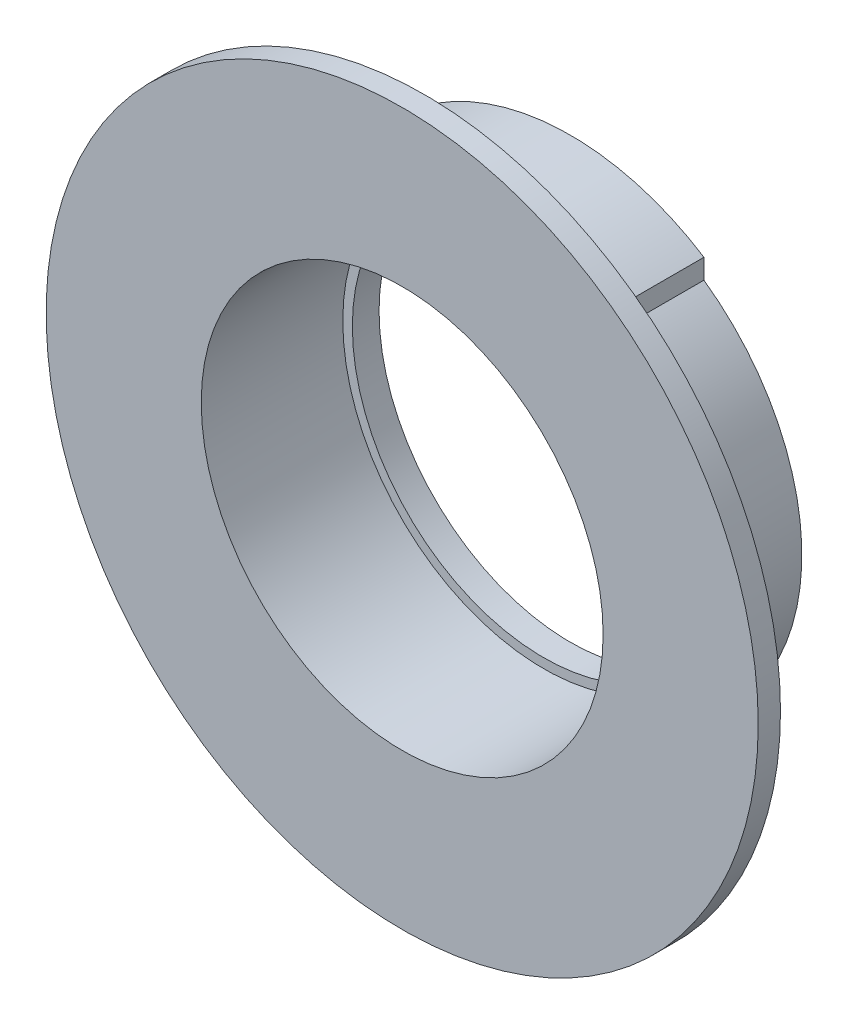
ISO-10303-21;
HEADER;
FILE_DESCRIPTION(('STEP AP214'),'2;1');
FILE_NAME('part.step','',(''),(''),'','','');
FILE_SCHEMA(('AUTOMOTIVE_DESIGN { 1 0 10303 214 1 1 1 1 }'));
ENDSEC;
DATA;
#1=APPLICATION_CONTEXT('core data for automotive mechanical design processes');
#2=APPLICATION_PROTOCOL_DEFINITION('international standard','automotive_design',2000,#1);
#3=PRODUCT_CONTEXT('',#1,'mechanical');
#4=PRODUCT('Part','Part','',(#3));
#5=PRODUCT_RELATED_PRODUCT_CATEGORY('part','',(#4));
#6=PRODUCT_DEFINITION_FORMATION('','',#4);
#7=PRODUCT_DEFINITION_CONTEXT('part definition',#1,'design');
#8=PRODUCT_DEFINITION('design','',#6,#7);
#9=PRODUCT_DEFINITION_SHAPE('','',#8);
#10=(LENGTH_UNIT() NAMED_UNIT(*) SI_UNIT(.MILLI.,.METRE.));
#11=(NAMED_UNIT(*) PLANE_ANGLE_UNIT() SI_UNIT($,.RADIAN.));
#12=(NAMED_UNIT(*) SI_UNIT($,.STERADIAN.) SOLID_ANGLE_UNIT());
#13=UNCERTAINTY_MEASURE_WITH_UNIT(LENGTH_MEASURE(1.E-05),#10,'distance_accuracy_value','');
#14=(GEOMETRIC_REPRESENTATION_CONTEXT(3) GLOBAL_UNCERTAINTY_ASSIGNED_CONTEXT((#13)) GLOBAL_UNIT_ASSIGNED_CONTEXT((#10,
#11,#12)) REPRESENTATION_CONTEXT('',''));
#15=CARTESIAN_POINT('',(0.,0.,0.));
#16=DIRECTION('',(0.,0.,1.));
#17=DIRECTION('',(1.,0.,0.));
#18=AXIS2_PLACEMENT_3D('',#15,#16,#17);
#19=CARTESIAN_POINT('',(0.,0.,0.));
#20=DIRECTION('',(0.,0.,1.));
#21=DIRECTION('',(1.,0.,0.));
#22=AXIS2_PLACEMENT_3D('',#19,#20,#21);
#23=PLANE('',#22);
#24=CARTESIAN_POINT('',(0.,0.,0.));
#25=DIRECTION('',(0.,0.,-1.));
#26=DIRECTION('',(-1.,0.,0.));
#27=AXIS2_PLACEMENT_3D('',#24,#25,#26);
#28=CIRCLE('',#27,21.5);
#29=CARTESIAN_POINT('',(-21.5,0.,0.));
#30=VERTEX_POINT('',#29);
#31=EDGE_CURVE('E112',#30,#30,#28,.T.);
#32=ORIENTED_EDGE('',*,*,#31,.F.);
#33=EDGE_LOOP('',(#32));
#34=FACE_BOUND('',#33,.T.);
#35=DIRECTION('',(0.,-1.,0.));
#36=VECTOR('',#35,1.);
#37=CARTESIAN_POINT('',(15.,0.,0.));
#38=LINE('',#37,#36);
#39=CARTESIAN_POINT('',(15.,-21.2367605815953,0.));
#40=VERTEX_POINT('',#39);
#41=CARTESIAN_POINT('',(15.,-23.4653467905335,0.));
#42=VERTEX_POINT('',#41);
#43=EDGE_CURVE('E118',#40,#42,#38,.T.);
#44=ORIENTED_EDGE('',*,*,#43,.T.);
#45=CARTESIAN_POINT('',(0.,0.,0.));
#46=DIRECTION('',(0.,0.,1.));
#47=DIRECTION('',(1.,0.,0.));
#48=AXIS2_PLACEMENT_3D('',#45,#46,#47);
#49=CIRCLE('',#48,27.85);
#50=CARTESIAN_POINT('',(-15.,-23.4653467905335,0.));
#51=VERTEX_POINT('',#50);
#52=EDGE_CURVE('E173',#51,#42,#49,.T.);
#53=ORIENTED_EDGE('',*,*,#52,.F.);
#54=DIRECTION('',(0.,-1.,0.));
#55=VECTOR('',#54,1.);
#56=CARTESIAN_POINT('',(-15.,0.,0.));
#57=LINE('',#56,#55);
#58=CARTESIAN_POINT('',(-15.,-21.2367605815953,0.));
#59=VERTEX_POINT('',#58);
#60=EDGE_CURVE('E138',#59,#51,#57,.T.);
#61=ORIENTED_EDGE('',*,*,#60,.F.);
#62=CARTESIAN_POINT('',(0.,0.,0.));
#63=DIRECTION('',(0.,0.,-1.));
#64=DIRECTION('',(-1.,0.,0.));
#65=AXIS2_PLACEMENT_3D('',#62,#63,#64);
#66=CIRCLE('',#65,26.);
#67=CARTESIAN_POINT('',(-15.,21.2367605815953,0.));
#68=VERTEX_POINT('',#67);
#69=EDGE_CURVE('E137',#59,#68,#66,.T.);
#70=ORIENTED_EDGE('',*,*,#69,.T.);
#71=CARTESIAN_POINT('',(-15.,23.4653467905335,0.));
#72=VERTEX_POINT('',#71);
#73=EDGE_CURVE('E140',#72,#68,#57,.T.);
#74=ORIENTED_EDGE('',*,*,#73,.F.);
#75=CARTESIAN_POINT('',(15.,23.4653467905335,0.));
#76=VERTEX_POINT('',#75);
#77=EDGE_CURVE('E43',#76,#72,#49,.T.);
#78=ORIENTED_EDGE('',*,*,#77,.F.);
#79=CARTESIAN_POINT('',(15.,21.2367605815953,0.));
#80=VERTEX_POINT('',#79);
#81=EDGE_CURVE('E127',#76,#80,#38,.T.);
#82=ORIENTED_EDGE('',*,*,#81,.T.);
#83=CARTESIAN_POINT('',(0.,0.,0.));
#84=DIRECTION('',(0.,0.,-1.));
#85=DIRECTION('',(-1.,0.,0.));
#86=AXIS2_PLACEMENT_3D('',#83,#84,#85);
#87=CIRCLE('',#86,26.);
#88=EDGE_CURVE('E122',#80,#40,#87,.T.);
#89=ORIENTED_EDGE('',*,*,#88,.T.);
#90=EDGE_LOOP('',(#44,#53,#61,#70,#74,#78,#82,#89));
#91=FACE_BOUND('',#90,.T.);
#92=ADVANCED_FACE('F39',(#34,#91),#23,.F.);
#93=CARTESIAN_POINT('',(0.,0.,16.4));
#94=DIRECTION('',(0.,0.,-1.));
#95=DIRECTION('',(-1.,0.,0.));
#96=AXIS2_PLACEMENT_3D('',#93,#94,#95);
#97=CYLINDRICAL_SURFACE('',#96,27.85);
#98=DIRECTION('',(0.,0.,-1.));
#99=VECTOR('',#98,1.);
#100=CARTESIAN_POINT('',(15.,-23.4653467905335,65.0581185415137));
#101=LINE('',#100,#99);
#102=CARTESIAN_POINT('',(15.,-23.4653467905335,16.4));
#103=VERTEX_POINT('',#102);
#104=EDGE_CURVE('E131',#103,#42,#101,.T.);
#105=ORIENTED_EDGE('',*,*,#104,.F.);
#106=CARTESIAN_POINT('',(0.,0.,16.4));
#107=DIRECTION('',(0.,0.,1.));
#108=DIRECTION('',(1.,0.,0.));
#109=AXIS2_PLACEMENT_3D('',#106,#107,#108);
#110=CIRCLE('',#109,27.85);
#111=CARTESIAN_POINT('',(-15.,-23.4653467905335,16.4));
#112=VERTEX_POINT('',#111);
#113=EDGE_CURVE('E48',#112,#103,#110,.T.);
#114=ORIENTED_EDGE('',*,*,#113,.F.);
#115=DIRECTION('',(0.,0.,-1.));
#116=VECTOR('',#115,1.);
#117=CARTESIAN_POINT('',(-15.,-23.4653467905335,65.0581185415137));
#118=LINE('',#117,#116);
#119=EDGE_CURVE('E146',#112,#51,#118,.T.);
#120=ORIENTED_EDGE('',*,*,#119,.T.);
#121=ORIENTED_EDGE('',*,*,#52,.T.);
#122=EDGE_LOOP('',(#105,#114,#120,#121));
#123=FACE_BOUND('',#122,.T.);
#124=ADVANCED_FACE('F41',(#123),#97,.T.);
#125=DIRECTION('',(0.,0.,-1.));
#126=VECTOR('',#125,1.);
#127=CARTESIAN_POINT('',(15.,23.4653467905335,65.0581185415137));
#128=LINE('',#127,#126);
#129=CARTESIAN_POINT('',(15.,23.4653467905335,16.4));
#130=VERTEX_POINT('',#129);
#131=EDGE_CURVE('E133',#130,#76,#128,.T.);
#132=ORIENTED_EDGE('',*,*,#131,.T.);
#133=ORIENTED_EDGE('',*,*,#77,.T.);
#134=DIRECTION('',(0.,0.,-1.));
#135=VECTOR('',#134,1.);
#136=CARTESIAN_POINT('',(-15.,23.4653467905335,65.0581185415137));
#137=LINE('',#136,#135);
#138=CARTESIAN_POINT('',(-15.,23.4653467905335,16.4));
#139=VERTEX_POINT('',#138);
#140=EDGE_CURVE('E152',#139,#72,#137,.T.);
#141=ORIENTED_EDGE('',*,*,#140,.F.);
#142=EDGE_CURVE('E11',#130,#139,#110,.T.);
#143=ORIENTED_EDGE('',*,*,#142,.F.);
#144=EDGE_LOOP('',(#132,#133,#141,#143));
#145=FACE_BOUND('',#144,.T.);
#146=ADVANCED_FACE('F196',(#145),#97,.T.);
#147=CARTESIAN_POINT('',(0.,0.,16.4));
#148=DIRECTION('',(0.,0.,-1.));
#149=DIRECTION('',(-1.,0.,0.));
#150=AXIS2_PLACEMENT_3D('',#147,#148,#149);
#151=CYLINDRICAL_SURFACE('',#150,22.575);
#152=CARTESIAN_POINT('',(0.,0.,18.9));
#153=DIRECTION('',(0.,0.,1.));
#154=DIRECTION('',(1.,0.,0.));
#155=AXIS2_PLACEMENT_3D('',#152,#153,#154);
#156=CIRCLE('',#155,22.575);
#157=CARTESIAN_POINT('',(22.575,0.,18.9));
#158=VERTEX_POINT('',#157);
#159=EDGE_CURVE('E166',#158,#158,#156,.T.);
#160=ORIENTED_EDGE('',*,*,#159,.T.);
#161=EDGE_LOOP('',(#160));
#162=FACE_BOUND('',#161,.T.);
#163=CARTESIAN_POINT('',(0.,0.,3.));
#164=DIRECTION('',(0.,0.,-1.));
#165=DIRECTION('',(-1.,0.,0.));
#166=AXIS2_PLACEMENT_3D('',#163,#164,#165);
#167=CIRCLE('',#166,22.575);
#168=CARTESIAN_POINT('',(-22.575,0.,3.));
#169=VERTEX_POINT('',#168);
#170=EDGE_CURVE('E161',#169,#169,#167,.T.);
#171=ORIENTED_EDGE('',*,*,#170,.T.);
#172=EDGE_LOOP('',(#171));
#173=FACE_BOUND('',#172,.T.);
#174=ADVANCED_FACE('F188',(#162,#173),#151,.F.);
#175=CARTESIAN_POINT('',(0.,0.,18.9));
#176=DIRECTION('',(0.,0.,1.));
#177=DIRECTION('',(1.,0.,0.));
#178=AXIS2_PLACEMENT_3D('',#175,#176,#177);
#179=PLANE('',#178);
#180=CARTESIAN_POINT('',(0.,0.,18.9));
#181=DIRECTION('',(0.,0.,1.));
#182=DIRECTION('',(1.,0.,0.));
#183=AXIS2_PLACEMENT_3D('',#180,#181,#182);
#184=CIRCLE('',#183,40.);
#185=CARTESIAN_POINT('',(40.,0.,18.9));
#186=VERTEX_POINT('',#185);
#187=EDGE_CURVE('E170',#186,#186,#184,.T.);
#188=ORIENTED_EDGE('',*,*,#187,.T.);
#189=EDGE_LOOP('',(#188));
#190=FACE_BOUND('',#189,.T.);
#191=ORIENTED_EDGE('',*,*,#159,.F.);
#192=EDGE_LOOP('',(#191));
#193=FACE_BOUND('',#192,.T.);
#194=ADVANCED_FACE('F179',(#190,#193),#179,.T.);
#195=CARTESIAN_POINT('',(0.,0.,16.4));
#196=DIRECTION('',(0.,0.,1.));
#197=DIRECTION('',(1.,0.,0.));
#198=AXIS2_PLACEMENT_3D('',#195,#196,#197);
#199=PLANE('',#198);
#200=ORIENTED_EDGE('',*,*,#142,.T.);
#201=DIRECTION('',(0.,-1.,0.));
#202=VECTOR('',#201,1.);
#203=CARTESIAN_POINT('',(-15.,0.,16.4));
#204=LINE('',#203,#202);
#205=CARTESIAN_POINT('',(-15.,21.2367605815953,16.4));
#206=VERTEX_POINT('',#205);
#207=EDGE_CURVE('E148',#139,#206,#204,.T.);
#208=ORIENTED_EDGE('',*,*,#207,.T.);
#209=CARTESIAN_POINT('',(0.,0.,16.4));
#210=DIRECTION('',(0.,0.,1.));
#211=DIRECTION('',(1.,0.,0.));
#212=AXIS2_PLACEMENT_3D('',#209,#210,#211);
#213=CIRCLE('',#212,26.);
#214=CARTESIAN_POINT('',(-15.,-21.2367605815953,16.4));
#215=VERTEX_POINT('',#214);
#216=EDGE_CURVE('E141',#215,#206,#213,.F.);
#217=ORIENTED_EDGE('',*,*,#216,.F.);
#218=DIRECTION('',(0.,-1.,0.));
#219=VECTOR('',#218,1.);
#220=CARTESIAN_POINT('',(-15.,0.,16.4));
#221=LINE('',#220,#219);
#222=EDGE_CURVE('E55',#215,#112,#221,.T.);
#223=ORIENTED_EDGE('',*,*,#222,.T.);
#224=ORIENTED_EDGE('',*,*,#113,.T.);
#225=DIRECTION('',(0.,-1.,0.));
#226=VECTOR('',#225,1.);
#227=CARTESIAN_POINT('',(15.,0.,16.4));
#228=LINE('',#227,#226);
#229=CARTESIAN_POINT('',(15.,-21.2367605815953,16.4));
#230=VERTEX_POINT('',#229);
#231=EDGE_CURVE('E103',#230,#103,#228,.T.);
#232=ORIENTED_EDGE('',*,*,#231,.F.);
#233=CARTESIAN_POINT('',(0.,0.,16.4));
#234=DIRECTION('',(0.,0.,1.));
#235=DIRECTION('',(1.,0.,0.));
#236=AXIS2_PLACEMENT_3D('',#233,#234,#235);
#237=CIRCLE('',#236,26.);
#238=CARTESIAN_POINT('',(15.,21.2367605815953,16.4));
#239=VERTEX_POINT('',#238);
#240=EDGE_CURVE('E108',#239,#230,#237,.F.);
#241=ORIENTED_EDGE('',*,*,#240,.F.);
#242=DIRECTION('',(0.,-1.,0.));
#243=VECTOR('',#242,1.);
#244=CARTESIAN_POINT('',(15.,0.,16.4));
#245=LINE('',#244,#243);
#246=EDGE_CURVE('E61',#130,#239,#245,.T.);
#247=ORIENTED_EDGE('',*,*,#246,.F.);
#248=EDGE_LOOP('',(#200,#208,#217,#223,#224,#232,#241,#247));
#249=FACE_BOUND('',#248,.T.);
#250=CARTESIAN_POINT('',(0.,0.,16.4));
#251=DIRECTION('',(0.,0.,1.));
#252=DIRECTION('',(1.,0.,0.));
#253=AXIS2_PLACEMENT_3D('',#250,#251,#252);
#254=CIRCLE('',#253,40.);
#255=CARTESIAN_POINT('',(40.,0.,16.4));
#256=VERTEX_POINT('',#255);
#257=EDGE_CURVE('E169',#256,#256,#254,.T.);
#258=ORIENTED_EDGE('',*,*,#257,.F.);
#259=EDGE_LOOP('',(#258));
#260=FACE_BOUND('',#259,.T.);
#261=ADVANCED_FACE('F105',(#249,#260),#199,.F.);
#262=CARTESIAN_POINT('',(0.,0.,18.9));
#263=DIRECTION('',(0.,0.,-1.));
#264=DIRECTION('',(-1.,0.,0.));
#265=AXIS2_PLACEMENT_3D('',#262,#263,#264);
#266=CYLINDRICAL_SURFACE('',#265,40.);
#267=ORIENTED_EDGE('',*,*,#187,.F.);
#268=EDGE_LOOP('',(#267));
#269=FACE_BOUND('',#268,.T.);
#270=ORIENTED_EDGE('',*,*,#257,.T.);
#271=EDGE_LOOP('',(#270));
#272=FACE_BOUND('',#271,.T.);
#273=ADVANCED_FACE('F177',(#269,#272),#266,.T.);
#274=CARTESIAN_POINT('',(0.,0.,3.));
#275=DIRECTION('',(0.,0.,-1.));
#276=DIRECTION('',(-1.,0.,0.));
#277=AXIS2_PLACEMENT_3D('',#274,#275,#276);
#278=PLANE('',#277);
#279=CARTESIAN_POINT('',(0.,0.,3.));
#280=DIRECTION('',(0.,0.,-1.));
#281=DIRECTION('',(-1.,0.,0.));
#282=AXIS2_PLACEMENT_3D('',#279,#280,#281);
#283=CIRCLE('',#282,21.5);
#284=CARTESIAN_POINT('',(-21.5,0.,3.));
#285=VERTEX_POINT('',#284);
#286=EDGE_CURVE('E158',#285,#285,#283,.T.);
#287=ORIENTED_EDGE('',*,*,#286,.T.);
#288=EDGE_LOOP('',(#287));
#289=FACE_BOUND('',#288,.T.);
#290=ORIENTED_EDGE('',*,*,#170,.F.);
#291=EDGE_LOOP('',(#290));
#292=FACE_BOUND('',#291,.T.);
#293=ADVANCED_FACE('F185',(#289,#292),#278,.F.);
#294=CARTESIAN_POINT('',(0.,0.,3.));
#295=DIRECTION('',(0.,0.,-1.));
#296=DIRECTION('',(-1.,0.,0.));
#297=AXIS2_PLACEMENT_3D('',#294,#295,#296);
#298=CYLINDRICAL_SURFACE('',#297,21.5);
#299=ORIENTED_EDGE('',*,*,#286,.F.);
#300=EDGE_LOOP('',(#299));
#301=FACE_BOUND('',#300,.T.);
#302=ORIENTED_EDGE('',*,*,#31,.T.);
#303=EDGE_LOOP('',(#302));
#304=FACE_BOUND('',#303,.T.);
#305=ADVANCED_FACE('F212',(#301,#304),#298,.F.);
#306=CARTESIAN_POINT('',(-15.,0.,65.0581185415137));
#307=DIRECTION('',(1.,0.,0.));
#308=DIRECTION('',(0.,0.,-1.));
#309=AXIS2_PLACEMENT_3D('',#306,#307,#308);
#310=PLANE('',#309);
#311=DIRECTION('',(0.,0.,-1.));
#312=VECTOR('',#311,1.);
#313=CARTESIAN_POINT('',(-15.,-21.2367605815953,65.0581185415137));
#314=LINE('',#313,#312);
#315=EDGE_CURVE('E144',#215,#59,#314,.T.);
#316=ORIENTED_EDGE('',*,*,#315,.T.);
#317=ORIENTED_EDGE('',*,*,#60,.T.);
#318=ORIENTED_EDGE('',*,*,#119,.F.);
#319=ORIENTED_EDGE('',*,*,#222,.F.);
#320=EDGE_LOOP('',(#316,#317,#318,#319));
#321=FACE_BOUND('',#320,.T.);
#322=ADVANCED_FACE('F218',(#321),#310,.F.);
#323=ORIENTED_EDGE('',*,*,#140,.T.);
#324=ORIENTED_EDGE('',*,*,#73,.T.);
#325=DIRECTION('',(0.,0.,-1.));
#326=VECTOR('',#325,1.);
#327=CARTESIAN_POINT('',(-15.,21.2367605815953,65.0581185415137));
#328=LINE('',#327,#326);
#329=EDGE_CURVE('E151',#206,#68,#328,.T.);
#330=ORIENTED_EDGE('',*,*,#329,.F.);
#331=ORIENTED_EDGE('',*,*,#207,.F.);
#332=EDGE_LOOP('',(#323,#324,#330,#331));
#333=FACE_BOUND('',#332,.T.);
#334=ADVANCED_FACE('F222',(#333),#310,.F.);
#335=CARTESIAN_POINT('',(0.,0.,65.0581185415137));
#336=DIRECTION('',(0.,0.,-1.));
#337=DIRECTION('',(-1.,0.,0.));
#338=AXIS2_PLACEMENT_3D('',#335,#336,#337);
#339=CYLINDRICAL_SURFACE('',#338,26.);
#340=ORIENTED_EDGE('',*,*,#216,.T.);
#341=ORIENTED_EDGE('',*,*,#329,.T.);
#342=ORIENTED_EDGE('',*,*,#69,.F.);
#343=ORIENTED_EDGE('',*,*,#315,.F.);
#344=EDGE_LOOP('',(#340,#341,#342,#343));
#345=FACE_BOUND('',#344,.T.);
#346=ADVANCED_FACE('F225',(#345),#339,.T.);
#347=CARTESIAN_POINT('',(0.,0.,65.0581185415137));
#348=DIRECTION('',(0.,0.,-1.));
#349=DIRECTION('',(-1.,0.,0.));
#350=AXIS2_PLACEMENT_3D('',#347,#348,#349);
#351=CYLINDRICAL_SURFACE('',#350,26.);
#352=ORIENTED_EDGE('',*,*,#240,.T.);
#353=DIRECTION('',(0.,0.,-1.));
#354=VECTOR('',#353,1.);
#355=CARTESIAN_POINT('',(15.,-21.2367605815953,65.0581185415137));
#356=LINE('',#355,#354);
#357=EDGE_CURVE('E115',#230,#40,#356,.T.);
#358=ORIENTED_EDGE('',*,*,#357,.T.);
#359=ORIENTED_EDGE('',*,*,#88,.F.);
#360=DIRECTION('',(0.,0.,-1.));
#361=VECTOR('',#360,1.);
#362=CARTESIAN_POINT('',(15.,21.2367605815953,65.0581185415137));
#363=LINE('',#362,#361);
#364=EDGE_CURVE('E125',#239,#80,#363,.T.);
#365=ORIENTED_EDGE('',*,*,#364,.F.);
#366=EDGE_LOOP('',(#352,#358,#359,#365));
#367=FACE_BOUND('',#366,.T.);
#368=ADVANCED_FACE('F124',(#367),#351,.T.);
#369=CARTESIAN_POINT('',(15.,0.,65.0581185415137));
#370=DIRECTION('',(1.,0.,0.));
#371=DIRECTION('',(0.,0.,-1.));
#372=AXIS2_PLACEMENT_3D('',#369,#370,#371);
#373=PLANE('',#372);
#374=ORIENTED_EDGE('',*,*,#231,.T.);
#375=ORIENTED_EDGE('',*,*,#104,.T.);
#376=ORIENTED_EDGE('',*,*,#43,.F.);
#377=ORIENTED_EDGE('',*,*,#357,.F.);
#378=EDGE_LOOP('',(#374,#375,#376,#377));
#379=FACE_BOUND('',#378,.T.);
#380=ADVANCED_FACE('F116',(#379),#373,.T.);
#381=ORIENTED_EDGE('',*,*,#246,.T.);
#382=ORIENTED_EDGE('',*,*,#364,.T.);
#383=ORIENTED_EDGE('',*,*,#81,.F.);
#384=ORIENTED_EDGE('',*,*,#131,.F.);
#385=EDGE_LOOP('',(#381,#382,#383,#384));
#386=FACE_BOUND('',#385,.T.);
#387=ADVANCED_FACE('F233',(#386),#373,.T.);
#388=CLOSED_SHELL('',(#92,#124,#146,#174,#194,#261,#273,#293,#305,#322,#334,#346,#368,#380,#387));
#389=MANIFOLD_SOLID_BREP('B2',#388);
#390=ADVANCED_BREP_SHAPE_REPRESENTATION('',(#18,#389),#14);
#391=SHAPE_DEFINITION_REPRESENTATION(#9,#390);
ENDSEC;
END-ISO-10303-21;
